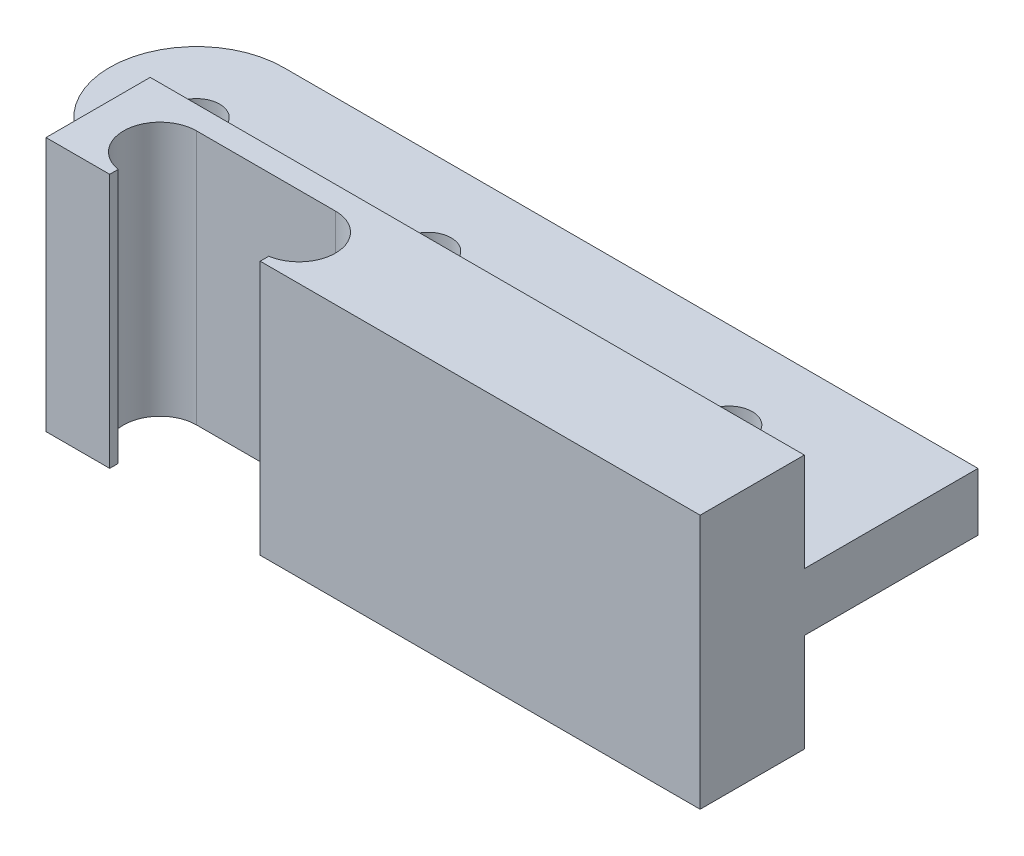
ISO-10303-21;
HEADER;
FILE_DESCRIPTION(('STEP AP214'),'2;1');
FILE_NAME('part.step','',(''),(''),'','','');
FILE_SCHEMA(('AUTOMOTIVE_DESIGN { 1 0 10303 214 1 1 1 1 }'));
ENDSEC;
DATA;
#1=APPLICATION_CONTEXT('core data for automotive mechanical design processes');
#2=APPLICATION_PROTOCOL_DEFINITION('international standard','automotive_design',2000,#1);
#3=PRODUCT_CONTEXT('',#1,'mechanical');
#4=PRODUCT('Part','Part','',(#3));
#5=PRODUCT_RELATED_PRODUCT_CATEGORY('part','',(#4));
#6=PRODUCT_DEFINITION_FORMATION('','',#4);
#7=PRODUCT_DEFINITION_CONTEXT('part definition',#1,'design');
#8=PRODUCT_DEFINITION('design','',#6,#7);
#9=PRODUCT_DEFINITION_SHAPE('','',#8);
#10=(LENGTH_UNIT() NAMED_UNIT(*) SI_UNIT(.MILLI.,.METRE.));
#11=(NAMED_UNIT(*) PLANE_ANGLE_UNIT() SI_UNIT($,.RADIAN.));
#12=(NAMED_UNIT(*) SI_UNIT($,.STERADIAN.) SOLID_ANGLE_UNIT());
#13=UNCERTAINTY_MEASURE_WITH_UNIT(LENGTH_MEASURE(1.E-05),#10,'distance_accuracy_value','');
#14=(GEOMETRIC_REPRESENTATION_CONTEXT(3) GLOBAL_UNCERTAINTY_ASSIGNED_CONTEXT((#13)) GLOBAL_UNIT_ASSIGNED_CONTEXT((#10,
#11,#12)) REPRESENTATION_CONTEXT('',''));
#15=CARTESIAN_POINT('',(0.,0.,0.));
#16=DIRECTION('',(0.,0.,1.));
#17=DIRECTION('',(1.,0.,0.));
#18=AXIS2_PLACEMENT_3D('',#15,#16,#17);
#19=CARTESIAN_POINT('',(-13.9975930765904,13.5,47.5639627706788));
#20=DIRECTION('',(0.,1.,0.));
#21=DIRECTION('',(-1.,0.,0.));
#22=AXIS2_PLACEMENT_3D('',#19,#20,#21);
#23=PLANE('',#22);
#24=DIRECTION('',(1.,0.,0.));
#25=VECTOR('',#24,1.);
#26=CARTESIAN_POINT('',(-13.9975930765904,13.5,47.5639627706788));
#27=LINE('',#26,#25);
#28=CARTESIAN_POINT('',(-13.9975930765904,13.5,47.5639627706788));
#29=VERTEX_POINT('',#28);
#30=CARTESIAN_POINT('',(-8.49759307659041,13.5,47.5639627706788));
#31=VERTEX_POINT('',#30);
#32=EDGE_CURVE('E163',#29,#31,#27,.T.);
#33=ORIENTED_EDGE('',*,*,#32,.T.);
#34=DIRECTION('',(0.,0.,-1.));
#35=VECTOR('',#34,1.);
#36=CARTESIAN_POINT('',(-8.49759307659041,13.5,47.5639627706788));
#37=LINE('',#36,#35);
#38=CARTESIAN_POINT('',(-8.49759307659042,13.5,46.8240270786956));
#39=VERTEX_POINT('',#38);
#40=EDGE_CURVE('E137',#31,#39,#37,.T.);
#41=ORIENTED_EDGE('',*,*,#40,.T.);
#42=CARTESIAN_POINT('',(-7.99759307659041,13.5,43.7139627706788));
#43=DIRECTION('',(0.,1.,0.));
#44=DIRECTION('',(-1.,0.,0.));
#45=AXIS2_PLACEMENT_3D('',#42,#43,#44);
#46=CIRCLE('',#45,3.15);
#47=CARTESIAN_POINT('',(-7.99759307659041,13.5,40.5639627706788));
#48=VERTEX_POINT('',#47);
#49=EDGE_CURVE('E286',#39,#48,#46,.F.);
#50=ORIENTED_EDGE('',*,*,#49,.T.);
#51=DIRECTION('',(1.,0.,0.));
#52=VECTOR('',#51,1.);
#53=CARTESIAN_POINT('',(-13.9975930765904,13.5,40.5639627706788));
#54=LINE('',#53,#52);
#55=CARTESIAN_POINT('',(4.00240692340959,13.5,40.5639627706788));
#56=VERTEX_POINT('',#55);
#57=EDGE_CURVE('E284',#48,#56,#54,.T.);
#58=ORIENTED_EDGE('',*,*,#57,.T.);
#59=CARTESIAN_POINT('',(4.00240692340959,13.5,43.7139627706788));
#60=DIRECTION('',(0.,1.,0.));
#61=DIRECTION('',(-1.,0.,0.));
#62=AXIS2_PLACEMENT_3D('',#59,#60,#61);
#63=CIRCLE('',#62,3.15);
#64=CARTESIAN_POINT('',(4.50240692340958,13.5,46.8240270786956));
#65=VERTEX_POINT('',#64);
#66=EDGE_CURVE('E240',#56,#65,#63,.F.);
#67=ORIENTED_EDGE('',*,*,#66,.T.);
#68=DIRECTION('',(0.,0.,1.));
#69=VECTOR('',#68,1.);
#70=CARTESIAN_POINT('',(4.50240692340959,13.5,47.5639627706788));
#71=LINE('',#70,#69);
#72=CARTESIAN_POINT('',(4.50240692340958,13.5,47.5639627706788));
#73=VERTEX_POINT('',#72);
#74=EDGE_CURVE('E230',#65,#73,#71,.T.);
#75=ORIENTED_EDGE('',*,*,#74,.T.);
#76=CARTESIAN_POINT('',(42.5024069234096,13.5,47.5639627706788));
#77=VERTEX_POINT('',#76);
#78=EDGE_CURVE('E168',#73,#77,#27,.T.);
#79=ORIENTED_EDGE('',*,*,#78,.T.);
#80=DIRECTION('',(0.,0.,-1.));
#81=VECTOR('',#80,1.);
#82=CARTESIAN_POINT('',(42.5024069234096,13.5,47.5639627706788));
#83=LINE('',#82,#81);
#84=CARTESIAN_POINT('',(42.5024069234096,13.5,38.5639627706788));
#85=VERTEX_POINT('',#84);
#86=EDGE_CURVE('E190',#77,#85,#83,.T.);
#87=ORIENTED_EDGE('',*,*,#86,.T.);
#88=DIRECTION('',(1.,0.,0.));
#89=VECTOR('',#88,1.);
#90=CARTESIAN_POINT('',(-13.9975930765904,13.5,38.5639627706788));
#91=LINE('',#90,#89);
#92=CARTESIAN_POINT('',(-13.9975930765904,13.5,38.5639627706788));
#93=VERTEX_POINT('',#92);
#94=EDGE_CURVE('E170',#93,#85,#91,.T.);
#95=ORIENTED_EDGE('',*,*,#94,.F.);
#96=DIRECTION('',(0.,0.,-1.));
#97=VECTOR('',#96,1.);
#98=CARTESIAN_POINT('',(-13.9975930765904,13.5,47.5639627706788));
#99=LINE('',#98,#97);
#100=EDGE_CURVE('E192',#29,#93,#99,.T.);
#101=ORIENTED_EDGE('',*,*,#100,.F.);
#102=EDGE_LOOP('',(#33,#41,#50,#58,#67,#75,#79,#87,#95,#101));
#103=FACE_BOUND('',#102,.T.);
#104=ADVANCED_FACE('F15',(#103),#23,.T.);
#105=CARTESIAN_POINT('',(42.5024069234096,-8.5,47.5639627706788));
#106=DIRECTION('',(0.,-1.,0.));
#107=DIRECTION('',(1.,0.,0.));
#108=AXIS2_PLACEMENT_3D('',#105,#106,#107);
#109=PLANE('',#108);
#110=CARTESIAN_POINT('',(-7.99759307659041,-8.50000000000001,43.7139627706788));
#111=DIRECTION('',(0.,1.,0.));
#112=DIRECTION('',(1.,0.,0.));
#113=AXIS2_PLACEMENT_3D('',#110,#111,#112);
#114=CIRCLE('',#113,3.15);
#115=CARTESIAN_POINT('',(-7.99759307659041,-8.50000000000001,40.5639627706788));
#116=VERTEX_POINT('',#115);
#117=CARTESIAN_POINT('',(-8.49759307659041,-8.50000000000001,46.8240270786956));
#118=VERTEX_POINT('',#117);
#119=EDGE_CURVE('E149',#116,#118,#114,.T.);
#120=ORIENTED_EDGE('',*,*,#119,.T.);
#121=DIRECTION('',(0.,0.,1.));
#122=VECTOR('',#121,1.);
#123=CARTESIAN_POINT('',(-8.49759307659041,-8.50000000000001,47.5639627706788));
#124=LINE('',#123,#122);
#125=CARTESIAN_POINT('',(-8.49759307659041,-8.50000000000001,47.5639627706788));
#126=VERTEX_POINT('',#125);
#127=EDGE_CURVE('E134',#118,#126,#124,.T.);
#128=ORIENTED_EDGE('',*,*,#127,.T.);
#129=DIRECTION('',(-1.,0.,0.));
#130=VECTOR('',#129,1.);
#131=CARTESIAN_POINT('',(42.5024069234096,-8.5,47.5639627706788));
#132=LINE('',#131,#130);
#133=CARTESIAN_POINT('',(-13.9975930765904,-8.50000000000001,47.5639627706788));
#134=VERTEX_POINT('',#133);
#135=EDGE_CURVE('E145',#126,#134,#132,.T.);
#136=ORIENTED_EDGE('',*,*,#135,.T.);
#137=DIRECTION('',(0.,0.,-1.));
#138=VECTOR('',#137,1.);
#139=CARTESIAN_POINT('',(-13.9975930765904,-8.50000000000001,47.5639627706788));
#140=LINE('',#139,#138);
#141=CARTESIAN_POINT('',(-13.9975930765904,-8.50000000000001,38.5639627706788));
#142=VERTEX_POINT('',#141);
#143=EDGE_CURVE('E161',#134,#142,#140,.T.);
#144=ORIENTED_EDGE('',*,*,#143,.T.);
#145=DIRECTION('',(-1.,0.,0.));
#146=VECTOR('',#145,1.);
#147=CARTESIAN_POINT('',(42.5024069234096,-8.5,38.5639627706788));
#148=LINE('',#147,#146);
#149=CARTESIAN_POINT('',(42.5024069234096,-8.5,38.5639627706788));
#150=VERTEX_POINT('',#149);
#151=EDGE_CURVE('E169',#150,#142,#148,.T.);
#152=ORIENTED_EDGE('',*,*,#151,.F.);
#153=DIRECTION('',(0.,0.,-1.));
#154=VECTOR('',#153,1.);
#155=CARTESIAN_POINT('',(42.5024069234096,-8.5,47.5639627706788));
#156=LINE('',#155,#154);
#157=CARTESIAN_POINT('',(42.5024069234096,-8.5,47.5639627706788));
#158=VERTEX_POINT('',#157);
#159=EDGE_CURVE('E187',#158,#150,#156,.T.);
#160=ORIENTED_EDGE('',*,*,#159,.F.);
#161=CARTESIAN_POINT('',(4.50240692340959,-8.50000000000001,47.5639627706788));
#162=VERTEX_POINT('',#161);
#163=EDGE_CURVE('E157',#158,#162,#132,.T.);
#164=ORIENTED_EDGE('',*,*,#163,.T.);
#165=DIRECTION('',(0.,0.,-1.));
#166=VECTOR('',#165,1.);
#167=CARTESIAN_POINT('',(4.50240692340959,-8.50000000000001,47.5639627706788));
#168=LINE('',#167,#166);
#169=CARTESIAN_POINT('',(4.50240692340959,-8.50000000000001,46.8240270786956));
#170=VERTEX_POINT('',#169);
#171=EDGE_CURVE('E151',#162,#170,#168,.T.);
#172=ORIENTED_EDGE('',*,*,#171,.T.);
#173=CARTESIAN_POINT('',(4.00240692340959,-8.50000000000001,43.7139627706788));
#174=DIRECTION('',(0.,1.,0.));
#175=DIRECTION('',(-1.,0.,0.));
#176=AXIS2_PLACEMENT_3D('',#173,#174,#175);
#177=CIRCLE('',#176,3.15);
#178=CARTESIAN_POINT('',(4.00240692340959,-8.50000000000001,40.5639627706788));
#179=VERTEX_POINT('',#178);
#180=EDGE_CURVE('E301',#170,#179,#177,.T.);
#181=ORIENTED_EDGE('',*,*,#180,.T.);
#182=DIRECTION('',(-1.,0.,0.));
#183=VECTOR('',#182,1.);
#184=CARTESIAN_POINT('',(-7.99759307659041,-8.50000000000001,40.5639627706788));
#185=LINE('',#184,#183);
#186=EDGE_CURVE('E298',#179,#116,#185,.T.);
#187=ORIENTED_EDGE('',*,*,#186,.T.);
#188=EDGE_LOOP('',(#120,#128,#136,#144,#152,#160,#164,#172,#181,#187));
#189=FACE_BOUND('',#188,.T.);
#190=ADVANCED_FACE('F143',(#189),#109,.T.);
#191=CARTESIAN_POINT('',(0.,0.,47.5639627706788));
#192=DIRECTION('',(0.,0.,-1.));
#193=DIRECTION('',(-1.,0.,0.));
#194=AXIS2_PLACEMENT_3D('',#191,#192,#193);
#195=PLANE('',#194);
#196=DIRECTION('',(0.,-1.,0.));
#197=VECTOR('',#196,1.);
#198=CARTESIAN_POINT('',(-8.49759307659041,0.,47.5639627706788));
#199=LINE('',#198,#197);
#200=EDGE_CURVE('E9',#31,#126,#199,.T.);
#201=ORIENTED_EDGE('',*,*,#200,.F.);
#202=ORIENTED_EDGE('',*,*,#32,.F.);
#203=DIRECTION('',(0.,1.,0.));
#204=VECTOR('',#203,1.);
#205=CARTESIAN_POINT('',(-13.9975930765904,-8.50000000000001,47.5639627706788));
#206=LINE('',#205,#204);
#207=EDGE_CURVE('E156',#134,#29,#206,.T.);
#208=ORIENTED_EDGE('',*,*,#207,.F.);
#209=ORIENTED_EDGE('',*,*,#135,.F.);
#210=EDGE_LOOP('',(#201,#202,#208,#209));
#211=FACE_BOUND('',#210,.T.);
#212=ADVANCED_FACE('F154',(#211),#195,.F.);
#213=DIRECTION('',(0.,1.,0.));
#214=VECTOR('',#213,1.);
#215=CARTESIAN_POINT('',(4.50240692340959,0.,47.5639627706788));
#216=LINE('',#215,#214);
#217=EDGE_CURVE('E23',#162,#73,#216,.T.);
#218=ORIENTED_EDGE('',*,*,#217,.F.);
#219=ORIENTED_EDGE('',*,*,#163,.F.);
#220=DIRECTION('',(0.,-1.,0.));
#221=VECTOR('',#220,1.);
#222=CARTESIAN_POINT('',(42.5024069234096,13.5,47.5639627706788));
#223=LINE('',#222,#221);
#224=EDGE_CURVE('E158',#77,#158,#223,.T.);
#225=ORIENTED_EDGE('',*,*,#224,.F.);
#226=ORIENTED_EDGE('',*,*,#78,.F.);
#227=EDGE_LOOP('',(#218,#219,#225,#226));
#228=FACE_BOUND('',#227,.T.);
#229=ADVANCED_FACE('F244',(#228),#195,.F.);
#230=CARTESIAN_POINT('',(-7.49759307659042,5.,23.5639627706788));
#231=DIRECTION('',(0.,0.,1.));
#232=DIRECTION('',(1.,0.,0.));
#233=AXIS2_PLACEMENT_3D('',#230,#231,#232);
#234=PLANE('',#233);
#235=DIRECTION('',(0.,-1.,0.));
#236=VECTOR('',#235,1.);
#237=CARTESIAN_POINT('',(-7.49759307659041,2.5,23.5639627706788));
#238=LINE('',#237,#236);
#239=CARTESIAN_POINT('',(-7.49759307659041,2.5,23.5639627706788));
#240=VERTEX_POINT('',#239);
#241=CARTESIAN_POINT('',(-7.49759307659041,0.,23.5639627706788));
#242=VERTEX_POINT('',#241);
#243=EDGE_CURVE('E260',#240,#242,#238,.T.);
#244=ORIENTED_EDGE('',*,*,#243,.F.);
#245=DIRECTION('',(-1.,0.,0.));
#246=VECTOR('',#245,1.);
#247=CARTESIAN_POINT('',(-7.49759307659041,2.5,23.5639627706788));
#248=LINE('',#247,#246);
#249=CARTESIAN_POINT('',(-17.4975930765904,2.5,23.5639627706788));
#250=VERTEX_POINT('',#249);
#251=EDGE_CURVE('E262',#240,#250,#248,.T.);
#252=ORIENTED_EDGE('',*,*,#251,.T.);
#253=DIRECTION('',(0.,-1.,0.));
#254=VECTOR('',#253,1.);
#255=CARTESIAN_POINT('',(-17.4975930765904,5.,23.5639627706788));
#256=LINE('',#255,#254);
#257=CARTESIAN_POINT('',(-17.4975930765904,5.,23.5639627706788));
#258=VERTEX_POINT('',#257);
#259=EDGE_CURVE('E221',#258,#250,#256,.T.);
#260=ORIENTED_EDGE('',*,*,#259,.F.);
#261=DIRECTION('',(-1.,0.,0.));
#262=VECTOR('',#261,1.);
#263=CARTESIAN_POINT('',(42.5024069234096,5.,23.5639627706788));
#264=LINE('',#263,#262);
#265=CARTESIAN_POINT('',(42.5024069234096,5.,23.5639627706788));
#266=VERTEX_POINT('',#265);
#267=EDGE_CURVE('E204',#266,#258,#264,.T.);
#268=ORIENTED_EDGE('',*,*,#267,.F.);
#269=DIRECTION('',(0.,-1.,0.));
#270=VECTOR('',#269,1.);
#271=CARTESIAN_POINT('',(42.5024069234096,5.,23.5639627706788));
#272=LINE('',#271,#270);
#273=CARTESIAN_POINT('',(42.5024069234096,0.,23.5639627706788));
#274=VERTEX_POINT('',#273);
#275=EDGE_CURVE('E224',#266,#274,#272,.T.);
#276=ORIENTED_EDGE('',*,*,#275,.T.);
#277=DIRECTION('',(-1.,0.,0.));
#278=VECTOR('',#277,1.);
#279=CARTESIAN_POINT('',(-7.49759307659042,0.,23.5639627706788));
#280=LINE('',#279,#278);
#281=EDGE_CURVE('E202',#274,#242,#280,.T.);
#282=ORIENTED_EDGE('',*,*,#281,.T.);
#283=EDGE_LOOP('',(#244,#252,#260,#268,#276,#282));
#284=FACE_BOUND('',#283,.T.);
#285=ADVANCED_FACE('F351',(#284),#234,.F.);
#286=CARTESIAN_POINT('',(-17.4975930765904,0.,31.0639627706788));
#287=DIRECTION('',(0.,1.,0.));
#288=DIRECTION('',(0.,0.,1.));
#289=AXIS2_PLACEMENT_3D('',#286,#287,#288);
#290=PLANE('',#289);
#291=CARTESIAN_POINT('',(2.50240692340959,0.,31.0639627706788));
#292=DIRECTION('',(0.,1.,0.));
#293=DIRECTION('',(0.,0.,-1.));
#294=AXIS2_PLACEMENT_3D('',#291,#292,#293);
#295=CIRCLE('',#294,2.);
#296=CARTESIAN_POINT('',(2.50240692340959,0.,29.0639627706788));
#297=VERTEX_POINT('',#296);
#298=EDGE_CURVE('E249',#297,#297,#295,.T.);
#299=ORIENTED_EDGE('',*,*,#298,.T.);
#300=EDGE_LOOP('',(#299));
#301=FACE_BOUND('',#300,.T.);
#302=CARTESIAN_POINT('',(28.5024069234096,0.,31.0639627706788));
#303=DIRECTION('',(0.,1.,0.));
#304=DIRECTION('',(0.,0.,-1.));
#305=AXIS2_PLACEMENT_3D('',#302,#303,#304);
#306=CIRCLE('',#305,2.);
#307=CARTESIAN_POINT('',(28.5024069234096,0.,29.0639627706788));
#308=VERTEX_POINT('',#307);
#309=EDGE_CURVE('E255',#308,#308,#306,.T.);
#310=ORIENTED_EDGE('',*,*,#309,.T.);
#311=EDGE_LOOP('',(#310));
#312=FACE_BOUND('',#311,.T.);
#313=DIRECTION('',(0.,0.,-1.));
#314=VECTOR('',#313,1.);
#315=CARTESIAN_POINT('',(-7.49759307659042,0.,38.5639627706788));
#316=LINE('',#315,#314);
#317=CARTESIAN_POINT('',(-7.49759307659042,0.,38.5639627706788));
#318=VERTEX_POINT('',#317);
#319=EDGE_CURVE('E263',#318,#242,#316,.T.);
#320=ORIENTED_EDGE('',*,*,#319,.T.);
#321=ORIENTED_EDGE('',*,*,#281,.F.);
#322=DIRECTION('',(0.,0.,-1.));
#323=VECTOR('',#322,1.);
#324=CARTESIAN_POINT('',(42.5024069234096,0.,38.5639627706788));
#325=LINE('',#324,#323);
#326=CARTESIAN_POINT('',(42.5024069234096,0.,38.5639627706788));
#327=VERTEX_POINT('',#326);
#328=EDGE_CURVE('E212',#327,#274,#325,.T.);
#329=ORIENTED_EDGE('',*,*,#328,.F.);
#330=DIRECTION('',(1.,0.,0.));
#331=VECTOR('',#330,1.);
#332=CARTESIAN_POINT('',(-7.49759307659042,0.,38.5639627706788));
#333=LINE('',#332,#331);
#334=EDGE_CURVE('E198',#318,#327,#333,.T.);
#335=ORIENTED_EDGE('',*,*,#334,.F.);
#336=EDGE_LOOP('',(#320,#321,#329,#335));
#337=FACE_BOUND('',#336,.T.);
#338=ADVANCED_FACE('F367',(#301,#312,#337),#290,.F.);
#339=CARTESIAN_POINT('',(-7.49759307659042,5.,38.5639627706788));
#340=DIRECTION('',(0.,0.,-1.));
#341=DIRECTION('',(-1.,0.,0.));
#342=AXIS2_PLACEMENT_3D('',#339,#340,#341);
#343=PLANE('',#342);
#344=DIRECTION('',(0.,-1.,0.));
#345=VECTOR('',#344,1.);
#346=CARTESIAN_POINT('',(-17.4975930765904,5.,38.5639627706788));
#347=LINE('',#346,#345);
#348=CARTESIAN_POINT('',(-17.4975930765904,5.,38.5639627706788));
#349=VERTEX_POINT('',#348);
#350=CARTESIAN_POINT('',(-17.4975930765904,2.5,38.5639627706788));
#351=VERTEX_POINT('',#350);
#352=EDGE_CURVE('E209',#349,#351,#347,.T.);
#353=ORIENTED_EDGE('',*,*,#352,.T.);
#354=DIRECTION('',(1.,0.,0.));
#355=VECTOR('',#354,1.);
#356=CARTESIAN_POINT('',(-17.4975930765904,2.5,38.5639627706788));
#357=LINE('',#356,#355);
#358=CARTESIAN_POINT('',(-13.9975930765904,2.5,38.5639627706788));
#359=VERTEX_POINT('',#358);
#360=EDGE_CURVE('E276',#351,#359,#357,.T.);
#361=ORIENTED_EDGE('',*,*,#360,.T.);
#362=DIRECTION('',(0.,1.,0.));
#363=VECTOR('',#362,1.);
#364=CARTESIAN_POINT('',(-13.9975930765904,-8.50000000000001,38.5639627706788));
#365=LINE('',#364,#363);
#366=CARTESIAN_POINT('',(-13.9975930765904,5.,38.5639627706788));
#367=VERTEX_POINT('',#366);
#368=EDGE_CURVE('E38',#359,#367,#365,.T.);
#369=ORIENTED_EDGE('',*,*,#368,.T.);
#370=DIRECTION('',(1.,0.,0.));
#371=VECTOR('',#370,1.);
#372=CARTESIAN_POINT('',(-7.49759307659042,5.,38.5639627706788));
#373=LINE('',#372,#371);
#374=EDGE_CURVE('E199',#349,#367,#373,.T.);
#375=ORIENTED_EDGE('',*,*,#374,.F.);
#376=EDGE_LOOP('',(#353,#361,#369,#375));
#377=FACE_BOUND('',#376,.T.);
#378=ADVANCED_FACE('F17',(#377),#343,.F.);
#379=CARTESIAN_POINT('',(42.5024069234096,5.,38.5639627706788));
#380=DIRECTION('',(-1.,0.,0.));
#381=DIRECTION('',(0.,0.,1.));
#382=AXIS2_PLACEMENT_3D('',#379,#380,#381);
#383=PLANE('',#382);
#384=ORIENTED_EDGE('',*,*,#328,.T.);
#385=ORIENTED_EDGE('',*,*,#275,.F.);
#386=DIRECTION('',(0.,0.,-1.));
#387=VECTOR('',#386,1.);
#388=CARTESIAN_POINT('',(42.5024069234096,5.,38.5639627706788));
#389=LINE('',#388,#387);
#390=CARTESIAN_POINT('',(42.5024069234096,5.,38.5639627706788));
#391=VERTEX_POINT('',#390);
#392=EDGE_CURVE('E201',#391,#266,#389,.T.);
#393=ORIENTED_EDGE('',*,*,#392,.F.);
#394=DIRECTION('',(0.,-1.,0.));
#395=VECTOR('',#394,1.);
#396=CARTESIAN_POINT('',(42.5024069234096,13.5,38.5639627706788));
#397=LINE('',#396,#395);
#398=EDGE_CURVE('E176',#85,#391,#397,.T.);
#399=ORIENTED_EDGE('',*,*,#398,.F.);
#400=ORIENTED_EDGE('',*,*,#86,.F.);
#401=ORIENTED_EDGE('',*,*,#224,.T.);
#402=ORIENTED_EDGE('',*,*,#159,.T.);
#403=EDGE_CURVE('E174',#327,#150,#397,.T.);
#404=ORIENTED_EDGE('',*,*,#403,.F.);
#405=EDGE_LOOP('',(#384,#385,#393,#399,#400,#401,#402,#404));
#406=FACE_BOUND('',#405,.T.);
#407=ADVANCED_FACE('F312',(#406),#383,.F.);
#408=CARTESIAN_POINT('',(-17.4975930765904,5.,31.0639627706788));
#409=DIRECTION('',(0.,-1.,0.));
#410=DIRECTION('',(0.,0.,-1.));
#411=AXIS2_PLACEMENT_3D('',#408,#409,#410);
#412=CYLINDRICAL_SURFACE('',#411,7.5);
#413=ORIENTED_EDGE('',*,*,#259,.T.);
#414=CARTESIAN_POINT('',(-17.4975930765904,2.5,31.0639627706788));
#415=DIRECTION('',(0.,1.,0.));
#416=DIRECTION('',(1.,0.,0.));
#417=AXIS2_PLACEMENT_3D('',#414,#415,#416);
#418=CIRCLE('',#417,7.5);
#419=EDGE_CURVE('E267',#250,#351,#418,.T.);
#420=ORIENTED_EDGE('',*,*,#419,.T.);
#421=ORIENTED_EDGE('',*,*,#352,.F.);
#422=CARTESIAN_POINT('',(-17.4975930765904,5.,31.0639627706788));
#423=DIRECTION('',(0.,1.,0.));
#424=DIRECTION('',(1.,0.,0.));
#425=AXIS2_PLACEMENT_3D('',#422,#423,#424);
#426=CIRCLE('',#425,7.5);
#427=EDGE_CURVE('E206',#258,#349,#426,.T.);
#428=ORIENTED_EDGE('',*,*,#427,.F.);
#429=EDGE_LOOP('',(#413,#420,#421,#428));
#430=FACE_BOUND('',#429,.T.);
#431=ADVANCED_FACE('F358',(#430),#412,.T.);
#432=CARTESIAN_POINT('',(-17.4975930765904,5.,31.0639627706788));
#433=DIRECTION('',(0.,1.,0.));
#434=DIRECTION('',(0.,0.,1.));
#435=AXIS2_PLACEMENT_3D('',#432,#433,#434);
#436=PLANE('',#435);
#437=CARTESIAN_POINT('',(-17.4975930765904,5.,31.0639627706788));
#438=DIRECTION('',(0.,1.,0.));
#439=DIRECTION('',(0.,0.,1.));
#440=AXIS2_PLACEMENT_3D('',#437,#438,#439);
#441=CIRCLE('',#440,2.);
#442=CARTESIAN_POINT('',(-17.4975930765904,5.,33.0639627706788));
#443=VERTEX_POINT('',#442);
#444=EDGE_CURVE('E268',#443,#443,#441,.T.);
#445=ORIENTED_EDGE('',*,*,#444,.F.);
#446=EDGE_LOOP('',(#445));
#447=FACE_BOUND('',#446,.T.);
#448=CARTESIAN_POINT('',(28.5024069234096,5.,31.0639627706788));
#449=DIRECTION('',(0.,1.,0.));
#450=DIRECTION('',(0.,0.,1.));
#451=AXIS2_PLACEMENT_3D('',#448,#449,#450);
#452=CIRCLE('',#451,2.);
#453=CARTESIAN_POINT('',(28.5024069234096,5.,33.0639627706788));
#454=VERTEX_POINT('',#453);
#455=EDGE_CURVE('E252',#454,#454,#452,.T.);
#456=ORIENTED_EDGE('',*,*,#455,.F.);
#457=EDGE_LOOP('',(#456));
#458=FACE_BOUND('',#457,.T.);
#459=CARTESIAN_POINT('',(2.50240692340959,5.,31.0639627706788));
#460=DIRECTION('',(0.,1.,0.));
#461=DIRECTION('',(0.,0.,1.));
#462=AXIS2_PLACEMENT_3D('',#459,#460,#461);
#463=CIRCLE('',#462,2.);
#464=CARTESIAN_POINT('',(2.50240692340959,5.,33.0639627706788));
#465=VERTEX_POINT('',#464);
#466=EDGE_CURVE('E246',#465,#465,#463,.T.);
#467=ORIENTED_EDGE('',*,*,#466,.F.);
#468=EDGE_LOOP('',(#467));
#469=FACE_BOUND('',#468,.T.);
#470=ORIENTED_EDGE('',*,*,#427,.T.);
#471=ORIENTED_EDGE('',*,*,#374,.T.);
#472=DIRECTION('',(-1.,0.,0.));
#473=VECTOR('',#472,1.);
#474=CARTESIAN_POINT('',(-17.4975930765904,5.,38.5639627706788));
#475=LINE('',#474,#473);
#476=EDGE_CURVE('E195',#391,#367,#475,.T.);
#477=ORIENTED_EDGE('',*,*,#476,.F.);
#478=ORIENTED_EDGE('',*,*,#392,.T.);
#479=ORIENTED_EDGE('',*,*,#267,.T.);
#480=EDGE_LOOP('',(#470,#471,#477,#478,#479));
#481=FACE_BOUND('',#480,.T.);
#482=ADVANCED_FACE('F355',(#447,#458,#469,#481),#436,.T.);
#483=CARTESIAN_POINT('',(0.,0.,38.5639627706788));
#484=DIRECTION('',(0.,0.,-1.));
#485=DIRECTION('',(-1.,0.,0.));
#486=AXIS2_PLACEMENT_3D('',#483,#484,#485);
#487=PLANE('',#486);
#488=ORIENTED_EDGE('',*,*,#151,.T.);
#489=EDGE_CURVE('E175',#142,#359,#365,.T.);
#490=ORIENTED_EDGE('',*,*,#489,.T.);
#491=CARTESIAN_POINT('',(-7.49759307659042,2.5,38.5639627706788));
#492=VERTEX_POINT('',#491);
#493=EDGE_CURVE('E271',#359,#492,#357,.T.);
#494=ORIENTED_EDGE('',*,*,#493,.T.);
#495=DIRECTION('',(0.,-1.,0.));
#496=VECTOR('',#495,1.);
#497=CARTESIAN_POINT('',(-7.49759307659042,2.5,38.5639627706788));
#498=LINE('',#497,#496);
#499=EDGE_CURVE('E258',#492,#318,#498,.T.);
#500=ORIENTED_EDGE('',*,*,#499,.T.);
#501=ORIENTED_EDGE('',*,*,#334,.T.);
#502=ORIENTED_EDGE('',*,*,#403,.T.);
#503=EDGE_LOOP('',(#488,#490,#494,#500,#501,#502));
#504=FACE_BOUND('',#503,.T.);
#505=ADVANCED_FACE('F323',(#504),#487,.T.);
#506=CARTESIAN_POINT('',(-13.9975930765904,-8.50000000000001,47.5639627706788));
#507=DIRECTION('',(-1.,0.,0.));
#508=DIRECTION('',(0.,0.,1.));
#509=AXIS2_PLACEMENT_3D('',#506,#507,#508);
#510=PLANE('',#509);
#511=ORIENTED_EDGE('',*,*,#489,.F.);
#512=ORIENTED_EDGE('',*,*,#143,.F.);
#513=ORIENTED_EDGE('',*,*,#207,.T.);
#514=ORIENTED_EDGE('',*,*,#100,.T.);
#515=EDGE_CURVE('E185',#367,#93,#365,.T.);
#516=ORIENTED_EDGE('',*,*,#515,.F.);
#517=ORIENTED_EDGE('',*,*,#368,.F.);
#518=EDGE_LOOP('',(#511,#512,#513,#514,#516,#517));
#519=FACE_BOUND('',#518,.T.);
#520=ADVANCED_FACE('F321',(#519),#510,.T.);
#521=ORIENTED_EDGE('',*,*,#398,.T.);
#522=ORIENTED_EDGE('',*,*,#476,.T.);
#523=ORIENTED_EDGE('',*,*,#515,.T.);
#524=ORIENTED_EDGE('',*,*,#94,.T.);
#525=EDGE_LOOP('',(#521,#522,#523,#524));
#526=FACE_BOUND('',#525,.T.);
#527=ADVANCED_FACE('F317',(#526),#487,.T.);
#528=CARTESIAN_POINT('',(2.50240692340959,0.,31.0639627706788));
#529=DIRECTION('',(0.,1.,0.));
#530=DIRECTION('',(0.,0.,-1.));
#531=AXIS2_PLACEMENT_3D('',#528,#529,#530);
#532=CYLINDRICAL_SURFACE('',#531,2.);
#533=ORIENTED_EDGE('',*,*,#466,.T.);
#534=EDGE_LOOP('',(#533));
#535=FACE_BOUND('',#534,.T.);
#536=ORIENTED_EDGE('',*,*,#298,.F.);
#537=EDGE_LOOP('',(#536));
#538=FACE_BOUND('',#537,.T.);
#539=ADVANCED_FACE('F401',(#535,#538),#532,.F.);
#540=CARTESIAN_POINT('',(28.5024069234096,0.,31.0639627706788));
#541=DIRECTION('',(0.,1.,0.));
#542=DIRECTION('',(0.,0.,-1.));
#543=AXIS2_PLACEMENT_3D('',#540,#541,#542);
#544=CYLINDRICAL_SURFACE('',#543,2.);
#545=ORIENTED_EDGE('',*,*,#455,.T.);
#546=EDGE_LOOP('',(#545));
#547=FACE_BOUND('',#546,.T.);
#548=ORIENTED_EDGE('',*,*,#309,.F.);
#549=EDGE_LOOP('',(#548));
#550=FACE_BOUND('',#549,.T.);
#551=ADVANCED_FACE('F404',(#547,#550),#544,.F.);
#552=CARTESIAN_POINT('',(-7.49759307659042,2.5,38.5639627706788));
#553=DIRECTION('',(-1.,0.,0.));
#554=DIRECTION('',(0.,0.,1.));
#555=AXIS2_PLACEMENT_3D('',#552,#553,#554);
#556=PLANE('',#555);
#557=ORIENTED_EDGE('',*,*,#319,.F.);
#558=ORIENTED_EDGE('',*,*,#499,.F.);
#559=DIRECTION('',(0.,0.,-1.));
#560=VECTOR('',#559,1.);
#561=CARTESIAN_POINT('',(-7.49759307659042,2.5,38.5639627706788));
#562=LINE('',#561,#560);
#563=EDGE_CURVE('E274',#492,#240,#562,.T.);
#564=ORIENTED_EDGE('',*,*,#563,.T.);
#565=ORIENTED_EDGE('',*,*,#243,.T.);
#566=EDGE_LOOP('',(#557,#558,#564,#565));
#567=FACE_BOUND('',#566,.T.);
#568=ADVANCED_FACE('F365',(#567),#556,.T.);
#569=CARTESIAN_POINT('',(-17.4975930765904,2.5,31.0639627706788));
#570=DIRECTION('',(0.,1.,0.));
#571=DIRECTION('',(0.,0.,1.));
#572=AXIS2_PLACEMENT_3D('',#569,#570,#571);
#573=PLANE('',#572);
#574=CARTESIAN_POINT('',(-17.4975930765904,2.5,31.0639627706788));
#575=DIRECTION('',(0.,1.,0.));
#576=DIRECTION('',(0.,0.,-1.));
#577=AXIS2_PLACEMENT_3D('',#574,#575,#576);
#578=CIRCLE('',#577,2.);
#579=CARTESIAN_POINT('',(-17.4975930765904,2.5,29.0639627706788));
#580=VERTEX_POINT('',#579);
#581=EDGE_CURVE('E280',#580,#580,#578,.T.);
#582=ORIENTED_EDGE('',*,*,#581,.T.);
#583=EDGE_LOOP('',(#582));
#584=FACE_BOUND('',#583,.T.);
#585=ORIENTED_EDGE('',*,*,#419,.F.);
#586=ORIENTED_EDGE('',*,*,#251,.F.);
#587=ORIENTED_EDGE('',*,*,#563,.F.);
#588=ORIENTED_EDGE('',*,*,#493,.F.);
#589=ORIENTED_EDGE('',*,*,#360,.F.);
#590=EDGE_LOOP('',(#585,#586,#587,#588,#589));
#591=FACE_BOUND('',#590,.T.);
#592=ADVANCED_FACE('F361',(#584,#591),#573,.F.);
#593=CARTESIAN_POINT('',(-17.4975930765904,2.5,31.0639627706788));
#594=DIRECTION('',(0.,1.,0.));
#595=DIRECTION('',(0.,0.,-1.));
#596=AXIS2_PLACEMENT_3D('',#593,#594,#595);
#597=CYLINDRICAL_SURFACE('',#596,2.);
#598=ORIENTED_EDGE('',*,*,#444,.T.);
#599=EDGE_LOOP('',(#598));
#600=FACE_BOUND('',#599,.T.);
#601=ORIENTED_EDGE('',*,*,#581,.F.);
#602=EDGE_LOOP('',(#601));
#603=FACE_BOUND('',#602,.T.);
#604=ADVANCED_FACE('F513',(#600,#603),#597,.F.);
#605=CARTESIAN_POINT('',(4.00240692340958,66.4416439638203,43.7139627706788));
#606=DIRECTION('',(0.,-1.,0.));
#607=DIRECTION('',(1.,0.,0.));
#608=AXIS2_PLACEMENT_3D('',#605,#606,#607);
#609=CYLINDRICAL_SURFACE('',#608,3.15);
#610=DIRECTION('',(0.,-1.,0.));
#611=VECTOR('',#610,1.);
#612=CARTESIAN_POINT('',(4.00240692340958,66.4416439638203,40.5639627706788));
#613=LINE('',#612,#611);
#614=EDGE_CURVE('E291',#56,#179,#613,.T.);
#615=ORIENTED_EDGE('',*,*,#614,.T.);
#616=ORIENTED_EDGE('',*,*,#180,.F.);
#617=DIRECTION('',(0.,-1.,0.));
#618=VECTOR('',#617,1.);
#619=CARTESIAN_POINT('',(4.50240692340958,66.4416439638203,46.8240270786956));
#620=LINE('',#619,#618);
#621=EDGE_CURVE('E241',#65,#170,#620,.T.);
#622=ORIENTED_EDGE('',*,*,#621,.F.);
#623=ORIENTED_EDGE('',*,*,#66,.F.);
#624=EDGE_LOOP('',(#615,#616,#622,#623));
#625=FACE_BOUND('',#624,.T.);
#626=ADVANCED_FACE('F524',(#625),#609,.F.);
#627=CARTESIAN_POINT('',(-7.99759307659042,66.4416439638203,40.5639627706788));
#628=DIRECTION('',(0.,0.,1.));
#629=DIRECTION('',(1.,0.,0.));
#630=AXIS2_PLACEMENT_3D('',#627,#628,#629);
#631=PLANE('',#630);
#632=DIRECTION('',(0.,-1.,0.));
#633=VECTOR('',#632,1.);
#634=CARTESIAN_POINT('',(-7.99759307659042,66.4416439638203,40.5639627706788));
#635=LINE('',#634,#633);
#636=EDGE_CURVE('E293',#48,#116,#635,.T.);
#637=ORIENTED_EDGE('',*,*,#636,.T.);
#638=ORIENTED_EDGE('',*,*,#186,.F.);
#639=ORIENTED_EDGE('',*,*,#614,.F.);
#640=ORIENTED_EDGE('',*,*,#57,.F.);
#641=EDGE_LOOP('',(#637,#638,#639,#640));
#642=FACE_BOUND('',#641,.T.);
#643=ADVANCED_FACE('F535',(#642),#631,.T.);
#644=CARTESIAN_POINT('',(-7.99759307659042,66.4416439638203,43.7139627706788));
#645=DIRECTION('',(0.,-1.,0.));
#646=DIRECTION('',(1.,0.,0.));
#647=AXIS2_PLACEMENT_3D('',#644,#645,#646);
#648=CYLINDRICAL_SURFACE('',#647,3.15);
#649=DIRECTION('',(0.,-1.,0.));
#650=VECTOR('',#649,1.);
#651=CARTESIAN_POINT('',(-8.49759307659042,66.4416439638203,46.8240270786956));
#652=LINE('',#651,#650);
#653=EDGE_CURVE('E30',#39,#118,#652,.T.);
#654=ORIENTED_EDGE('',*,*,#653,.T.);
#655=ORIENTED_EDGE('',*,*,#119,.F.);
#656=ORIENTED_EDGE('',*,*,#636,.F.);
#657=ORIENTED_EDGE('',*,*,#49,.F.);
#658=EDGE_LOOP('',(#654,#655,#656,#657));
#659=FACE_BOUND('',#658,.T.);
#660=ADVANCED_FACE('F546',(#659),#648,.F.);
#661=CARTESIAN_POINT('',(-8.49759307659042,66.4416439638203,47.5639627706788));
#662=DIRECTION('',(1.,0.,0.));
#663=DIRECTION('',(0.,1.,0.));
#664=AXIS2_PLACEMENT_3D('',#661,#662,#663);
#665=PLANE('',#664);
#666=ORIENTED_EDGE('',*,*,#200,.T.);
#667=ORIENTED_EDGE('',*,*,#127,.F.);
#668=ORIENTED_EDGE('',*,*,#653,.F.);
#669=ORIENTED_EDGE('',*,*,#40,.F.);
#670=EDGE_LOOP('',(#666,#667,#668,#669));
#671=FACE_BOUND('',#670,.T.);
#672=ADVANCED_FACE('F133',(#671),#665,.T.);
#673=CARTESIAN_POINT('',(4.50240692340958,66.4416439638203,47.5639627706788));
#674=DIRECTION('',(-1.,0.,0.));
#675=DIRECTION('',(0.,0.,1.));
#676=AXIS2_PLACEMENT_3D('',#673,#674,#675);
#677=PLANE('',#676);
#678=ORIENTED_EDGE('',*,*,#621,.T.);
#679=ORIENTED_EDGE('',*,*,#171,.F.);
#680=ORIENTED_EDGE('',*,*,#217,.T.);
#681=ORIENTED_EDGE('',*,*,#74,.F.);
#682=EDGE_LOOP('',(#678,#679,#680,#681));
#683=FACE_BOUND('',#682,.T.);
#684=ADVANCED_FACE('F229',(#683),#677,.T.);
#685=CLOSED_SHELL('',(#104,#190,#212,#229,#285,#338,#378,#407,#431,#482,#505,#520,#527,#539,
#551,#568,#592,#604,#626,#643,#660,#672,#684));
#686=MANIFOLD_SOLID_BREP('B1',#685);
#687=ADVANCED_BREP_SHAPE_REPRESENTATION('',(#18,#686),#14);
#688=SHAPE_DEFINITION_REPRESENTATION(#9,#687);
ENDSEC;
END-ISO-10303-21;
